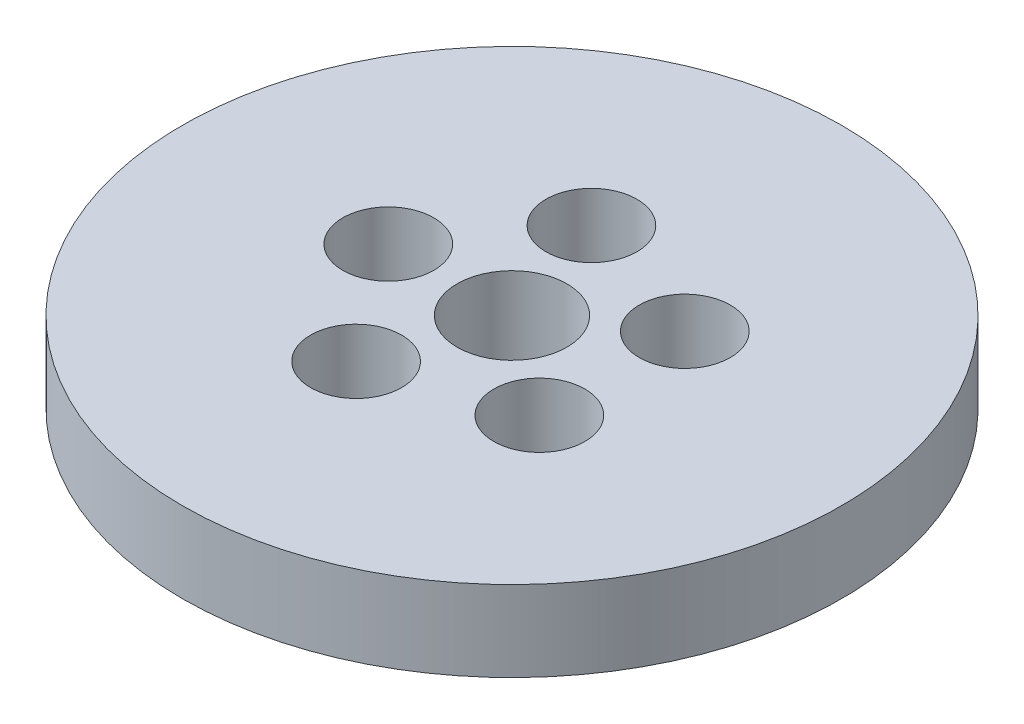
ISO-10303-21;
HEADER;
FILE_DESCRIPTION(('STEP AP214'),'2;1');
FILE_NAME('part.step','',(''),(''),'','','');
FILE_SCHEMA(('AUTOMOTIVE_DESIGN { 1 0 10303 214 1 1 1 1 }'));
ENDSEC;
DATA;
#1=APPLICATION_CONTEXT('core data for automotive mechanical design processes');
#2=APPLICATION_PROTOCOL_DEFINITION('international standard','automotive_design',2000,#1);
#3=PRODUCT_CONTEXT('',#1,'mechanical');
#4=PRODUCT('Part','Part','',(#3));
#5=PRODUCT_RELATED_PRODUCT_CATEGORY('part','',(#4));
#6=PRODUCT_DEFINITION_FORMATION('','',#4);
#7=PRODUCT_DEFINITION_CONTEXT('part definition',#1,'design');
#8=PRODUCT_DEFINITION('design','',#6,#7);
#9=PRODUCT_DEFINITION_SHAPE('','',#8);
#10=(LENGTH_UNIT() NAMED_UNIT(*) SI_UNIT(.MILLI.,.METRE.));
#11=(NAMED_UNIT(*) PLANE_ANGLE_UNIT() SI_UNIT($,.RADIAN.));
#12=(NAMED_UNIT(*) SI_UNIT($,.STERADIAN.) SOLID_ANGLE_UNIT());
#13=UNCERTAINTY_MEASURE_WITH_UNIT(LENGTH_MEASURE(1.E-05),#10,'distance_accuracy_value','');
#14=(GEOMETRIC_REPRESENTATION_CONTEXT(3) GLOBAL_UNCERTAINTY_ASSIGNED_CONTEXT((#13)) GLOBAL_UNIT_ASSIGNED_CONTEXT((#10,
#11,#12)) REPRESENTATION_CONTEXT('',''));
#15=CARTESIAN_POINT('',(0.,0.,0.));
#16=DIRECTION('',(0.,0.,1.));
#17=DIRECTION('',(1.,0.,0.));
#18=AXIS2_PLACEMENT_3D('',#15,#16,#17);
#19=CARTESIAN_POINT('',(0.,11.,0.));
#20=DIRECTION('',(0.,-1.,0.));
#21=DIRECTION('',(0.,0.,-1.));
#22=AXIS2_PLACEMENT_3D('',#19,#20,#21);
#23=CYLINDRICAL_SURFACE('',#22,45.);
#24=CARTESIAN_POINT('',(0.,11.,0.));
#25=DIRECTION('',(0.,1.,0.));
#26=DIRECTION('',(0.,0.,1.));
#27=AXIS2_PLACEMENT_3D('',#24,#25,#26);
#28=CIRCLE('',#27,45.);
#29=CARTESIAN_POINT('',(0.,11.,45.));
#30=VERTEX_POINT('',#29);
#31=EDGE_CURVE('E10',#30,#30,#28,.T.);
#32=ORIENTED_EDGE('',*,*,#31,.F.);
#33=EDGE_LOOP('',(#32));
#34=FACE_BOUND('',#33,.T.);
#35=CARTESIAN_POINT('',(0.,0.,0.));
#36=DIRECTION('',(0.,1.,0.));
#37=DIRECTION('',(0.,0.,1.));
#38=AXIS2_PLACEMENT_3D('',#35,#36,#37);
#39=CIRCLE('',#38,45.);
#40=CARTESIAN_POINT('',(0.,0.,45.));
#41=VERTEX_POINT('',#40);
#42=EDGE_CURVE('E37',#41,#41,#39,.T.);
#43=ORIENTED_EDGE('',*,*,#42,.T.);
#44=EDGE_LOOP('',(#43));
#45=FACE_BOUND('',#44,.T.);
#46=ADVANCED_FACE('F40',(#34,#45),#23,.T.);
#47=CARTESIAN_POINT('',(0.,11.,0.));
#48=DIRECTION('',(0.,1.,0.));
#49=DIRECTION('',(0.,0.,1.));
#50=AXIS2_PLACEMENT_3D('',#47,#48,#49);
#51=PLANE('',#50);
#52=CARTESIAN_POINT('',(-5.22009665162509,11.,-16.0658055271696));
#53=DIRECTION('',(0.,1.,0.));
#54=DIRECTION('',(-0.95105651629515,0.,0.309016994374958));
#55=AXIS2_PLACEMENT_3D('',#52,#53,#54);
#56=CIRCLE('',#55,6.2176523093823);
#57=CARTESIAN_POINT('',(-11.1334353965207,11.,-14.1444452984558));
#58=VERTEX_POINT('',#57);
#59=EDGE_CURVE('E70',#58,#58,#56,.T.);
#60=ORIENTED_EDGE('',*,*,#59,.F.);
#61=EDGE_LOOP('',(#60));
#62=FACE_BOUND('',#61,.T.);
#63=CARTESIAN_POINT('',(13.6663904585134,11.,-9.92921387243688));
#64=DIRECTION('',(0.,1.,0.));
#65=DIRECTION('',(-0.58778525229248,0.,-0.809016994374942));
#66=AXIS2_PLACEMENT_3D('',#63,#64,#65);
#67=CIRCLE('',#66,6.2176523093823);
#68=CARTESIAN_POINT('',(10.0117461271762,11.,-14.9594002558418));
#69=VERTEX_POINT('',#68);
#70=EDGE_CURVE('E71',#69,#69,#67,.T.);
#71=ORIENTED_EDGE('',*,*,#70,.F.);
#72=EDGE_LOOP('',(#71));
#73=FACE_BOUND('',#72,.T.);
#74=CARTESIAN_POINT('',(13.6663904585136,11.,9.92921387243669));
#75=DIRECTION('',(0.,1.,0.));
#76=DIRECTION('',(0.587785252292469,0.,-0.809016994374951));
#77=AXIS2_PLACEMENT_3D('',#74,#75,#76);
#78=CIRCLE('',#77,6.2176523093823);
#79=CARTESIAN_POINT('',(17.3210347898507,11.,4.89902748903175));
#80=VERTEX_POINT('',#79);
#81=EDGE_CURVE('E78',#80,#80,#78,.T.);
#82=ORIENTED_EDGE('',*,*,#81,.F.);
#83=EDGE_LOOP('',(#82));
#84=FACE_BOUND('',#83,.T.);
#85=CARTESIAN_POINT('',(-5.22009665162486,11.,16.0658055271697));
#86=DIRECTION('',(0.,1.,0.));
#87=DIRECTION('',(0.951056516295155,0.,0.309016994374945));
#88=AXIS2_PLACEMENT_3D('',#85,#86,#87);
#89=CIRCLE('',#88,6.2176523093823);
#90=CARTESIAN_POINT('',(0.693242093270787,11.,17.9871657558834));
#91=VERTEX_POINT('',#90);
#92=EDGE_CURVE('E61',#91,#91,#89,.T.);
#93=ORIENTED_EDGE('',*,*,#92,.F.);
#94=EDGE_LOOP('',(#93));
#95=FACE_BOUND('',#94,.T.);
#96=CARTESIAN_POINT('',(-16.8925876137772,11.,0.));
#97=DIRECTION('',(0.,1.,0.));
#98=DIRECTION('',(0.,0.,1.));
#99=AXIS2_PLACEMENT_3D('',#96,#97,#98);
#100=CIRCLE('',#99,6.2176523093823);
#101=CARTESIAN_POINT('',(-16.8925876137772,11.,6.2176523093823));
#102=VERTEX_POINT('',#101);
#103=EDGE_CURVE('E54',#102,#102,#100,.T.);
#104=ORIENTED_EDGE('',*,*,#103,.F.);
#105=EDGE_LOOP('',(#104));
#106=FACE_BOUND('',#105,.T.);
#107=CARTESIAN_POINT('',(0.,11.,0.));
#108=DIRECTION('',(0.,1.,0.));
#109=DIRECTION('',(0.,0.,1.));
#110=AXIS2_PLACEMENT_3D('',#107,#108,#109);
#111=CIRCLE('',#110,7.5);
#112=CARTESIAN_POINT('',(0.,11.,7.5));
#113=VERTEX_POINT('',#112);
#114=EDGE_CURVE('E50',#113,#113,#111,.T.);
#115=ORIENTED_EDGE('',*,*,#114,.F.);
#116=EDGE_LOOP('',(#115));
#117=FACE_BOUND('',#116,.T.);
#118=ORIENTED_EDGE('',*,*,#31,.T.);
#119=EDGE_LOOP('',(#118));
#120=FACE_BOUND('',#119,.T.);
#121=ADVANCED_FACE('F94',(#62,#73,#84,#95,#106,#117,#120),#51,.T.);
#122=CARTESIAN_POINT('',(0.,0.,0.));
#123=DIRECTION('',(0.,1.,0.));
#124=DIRECTION('',(0.,0.,1.));
#125=AXIS2_PLACEMENT_3D('',#122,#123,#124);
#126=PLANE('',#125);
#127=CARTESIAN_POINT('',(0.,0.,0.));
#128=DIRECTION('',(0.,1.,0.));
#129=DIRECTION('',(0.,0.,1.));
#130=AXIS2_PLACEMENT_3D('',#127,#128,#129);
#131=CIRCLE('',#130,7.5);
#132=CARTESIAN_POINT('',(0.,0.,7.5));
#133=VERTEX_POINT('',#132);
#134=EDGE_CURVE('E47',#133,#133,#131,.T.);
#135=ORIENTED_EDGE('',*,*,#134,.T.);
#136=EDGE_LOOP('',(#135));
#137=FACE_BOUND('',#136,.T.);
#138=ORIENTED_EDGE('',*,*,#42,.F.);
#139=EDGE_LOOP('',(#138));
#140=FACE_BOUND('',#139,.T.);
#141=ADVANCED_FACE('F100',(#137,#140),#126,.F.);
#142=CARTESIAN_POINT('',(0.,11.,0.));
#143=DIRECTION('',(0.,-1.,0.));
#144=DIRECTION('',(0.,0.,-1.));
#145=AXIS2_PLACEMENT_3D('',#142,#143,#144);
#146=CYLINDRICAL_SURFACE('',#145,7.5);
#147=ORIENTED_EDGE('',*,*,#114,.T.);
#148=EDGE_LOOP('',(#147));
#149=FACE_BOUND('',#148,.T.);
#150=ORIENTED_EDGE('',*,*,#134,.F.);
#151=EDGE_LOOP('',(#150));
#152=FACE_BOUND('',#151,.T.);
#153=ADVANCED_FACE('F106',(#149,#152),#146,.F.);
#154=CARTESIAN_POINT('',(-16.8925876137772,0.397864549196438,0.));
#155=DIRECTION('',(0.,1.,0.));
#156=DIRECTION('',(0.,0.,1.));
#157=AXIS2_PLACEMENT_3D('',#154,#155,#156);
#158=CYLINDRICAL_SURFACE('',#157,6.2176523093823);
#159=CARTESIAN_POINT('',(-16.8925876137772,0.397864549196438,0.));
#160=DIRECTION('',(0.,1.,0.));
#161=DIRECTION('',(0.,0.,1.));
#162=AXIS2_PLACEMENT_3D('',#159,#160,#161);
#163=CIRCLE('',#162,6.2176523093823);
#164=CARTESIAN_POINT('',(-16.8925876137772,0.397864549196438,6.2176523093823));
#165=VERTEX_POINT('',#164);
#166=EDGE_CURVE('E55',#165,#165,#163,.T.);
#167=ORIENTED_EDGE('',*,*,#166,.F.);
#168=EDGE_LOOP('',(#167));
#169=FACE_BOUND('',#168,.T.);
#170=ORIENTED_EDGE('',*,*,#103,.T.);
#171=EDGE_LOOP('',(#170));
#172=FACE_BOUND('',#171,.T.);
#173=ADVANCED_FACE('F108',(#169,#172),#158,.F.);
#174=CARTESIAN_POINT('',(-16.8925876137772,0.397864549196438,0.));
#175=DIRECTION('',(0.,1.,0.));
#176=DIRECTION('',(0.,0.,1.));
#177=AXIS2_PLACEMENT_3D('',#174,#175,#176);
#178=PLANE('',#177);
#179=ORIENTED_EDGE('',*,*,#166,.T.);
#180=EDGE_LOOP('',(#179));
#181=FACE_BOUND('',#180,.T.);
#182=ADVANCED_FACE('F138',(#181),#178,.T.);
#183=CARTESIAN_POINT('',(-5.22009665162486,0.397864549196438,16.0658055271697));
#184=DIRECTION('',(0.,1.,0.));
#185=DIRECTION('',(0.,0.,1.));
#186=AXIS2_PLACEMENT_3D('',#183,#184,#185);
#187=CYLINDRICAL_SURFACE('',#186,6.2176523093823);
#188=CARTESIAN_POINT('',(-5.22009665162486,0.397864549196438,16.0658055271697));
#189=DIRECTION('',(0.,1.,0.));
#190=DIRECTION('',(0.951056516295155,0.,0.309016994374945));
#191=AXIS2_PLACEMENT_3D('',#188,#189,#190);
#192=CIRCLE('',#191,6.2176523093823);
#193=CARTESIAN_POINT('',(0.693242093270787,0.397864549196438,17.9871657558834));
#194=VERTEX_POINT('',#193);
#195=EDGE_CURVE('E59',#194,#194,#192,.T.);
#196=ORIENTED_EDGE('',*,*,#195,.F.);
#197=EDGE_LOOP('',(#196));
#198=FACE_BOUND('',#197,.T.);
#199=ORIENTED_EDGE('',*,*,#92,.T.);
#200=EDGE_LOOP('',(#199));
#201=FACE_BOUND('',#200,.T.);
#202=ADVANCED_FACE('F150',(#198,#201),#187,.F.);
#203=CARTESIAN_POINT('',(-5.22009665162486,0.397864549196438,16.0658055271697));
#204=DIRECTION('',(0.,1.,0.));
#205=DIRECTION('',(0.951056516295155,0.,0.309016994374945));
#206=AXIS2_PLACEMENT_3D('',#203,#204,#205);
#207=PLANE('',#206);
#208=ORIENTED_EDGE('',*,*,#195,.T.);
#209=EDGE_LOOP('',(#208));
#210=FACE_BOUND('',#209,.T.);
#211=ADVANCED_FACE('F89',(#210),#207,.T.);
#212=CARTESIAN_POINT('',(13.6663904585136,0.397864549196438,9.92921387243669));
#213=DIRECTION('',(0.,1.,0.));
#214=DIRECTION('',(0.,0.,1.));
#215=AXIS2_PLACEMENT_3D('',#212,#213,#214);
#216=CYLINDRICAL_SURFACE('',#215,6.2176523093823);
#217=CARTESIAN_POINT('',(13.6663904585136,0.397864549196438,9.92921387243669));
#218=DIRECTION('',(0.,1.,0.));
#219=DIRECTION('',(0.587785252292469,0.,-0.809016994374951));
#220=AXIS2_PLACEMENT_3D('',#217,#218,#219);
#221=CIRCLE('',#220,6.2176523093823);
#222=CARTESIAN_POINT('',(17.3210347898507,0.397864549196438,4.89902748903175));
#223=VERTEX_POINT('',#222);
#224=EDGE_CURVE('E63',#223,#223,#221,.T.);
#225=ORIENTED_EDGE('',*,*,#224,.F.);
#226=EDGE_LOOP('',(#225));
#227=FACE_BOUND('',#226,.T.);
#228=ORIENTED_EDGE('',*,*,#81,.T.);
#229=EDGE_LOOP('',(#228));
#230=FACE_BOUND('',#229,.T.);
#231=ADVANCED_FACE('F87',(#227,#230),#216,.F.);
#232=CARTESIAN_POINT('',(13.6663904585136,0.397864549196438,9.92921387243669));
#233=DIRECTION('',(0.,1.,0.));
#234=DIRECTION('',(0.587785252292469,0.,-0.809016994374951));
#235=AXIS2_PLACEMENT_3D('',#232,#233,#234);
#236=PLANE('',#235);
#237=ORIENTED_EDGE('',*,*,#224,.T.);
#238=EDGE_LOOP('',(#237));
#239=FACE_BOUND('',#238,.T.);
#240=ADVANCED_FACE('F84',(#239),#236,.T.);
#241=CARTESIAN_POINT('',(13.6663904585134,0.397864549196438,-9.92921387243688));
#242=DIRECTION('',(0.,1.,0.));
#243=DIRECTION('',(0.,0.,1.));
#244=AXIS2_PLACEMENT_3D('',#241,#242,#243);
#245=CYLINDRICAL_SURFACE('',#244,6.2176523093823);
#246=CARTESIAN_POINT('',(13.6663904585134,0.397864549196438,-9.92921387243688));
#247=DIRECTION('',(0.,1.,0.));
#248=DIRECTION('',(-0.58778525229248,0.,-0.809016994374942));
#249=AXIS2_PLACEMENT_3D('',#246,#247,#248);
#250=CIRCLE('',#249,6.2176523093823);
#251=CARTESIAN_POINT('',(10.0117461271762,0.397864549196438,-14.9594002558418));
#252=VERTEX_POINT('',#251);
#253=EDGE_CURVE('E76',#252,#252,#250,.T.);
#254=ORIENTED_EDGE('',*,*,#253,.F.);
#255=EDGE_LOOP('',(#254));
#256=FACE_BOUND('',#255,.T.);
#257=ORIENTED_EDGE('',*,*,#70,.T.);
#258=EDGE_LOOP('',(#257));
#259=FACE_BOUND('',#258,.T.);
#260=ADVANCED_FACE('F185',(#256,#259),#245,.F.);
#261=CARTESIAN_POINT('',(13.6663904585134,0.397864549196438,-9.92921387243688));
#262=DIRECTION('',(0.,1.,0.));
#263=DIRECTION('',(-0.58778525229248,0.,-0.809016994374942));
#264=AXIS2_PLACEMENT_3D('',#261,#262,#263);
#265=PLANE('',#264);
#266=ORIENTED_EDGE('',*,*,#253,.T.);
#267=EDGE_LOOP('',(#266));
#268=FACE_BOUND('',#267,.T.);
#269=ADVANCED_FACE('F189',(#268),#265,.T.);
#270=CARTESIAN_POINT('',(-5.22009665162509,0.397864549196438,-16.0658055271696));
#271=DIRECTION('',(0.,1.,0.));
#272=DIRECTION('',(0.,0.,1.));
#273=AXIS2_PLACEMENT_3D('',#270,#271,#272);
#274=CYLINDRICAL_SURFACE('',#273,6.2176523093823);
#275=CARTESIAN_POINT('',(-5.22009665162509,0.397864549196438,-16.0658055271696));
#276=DIRECTION('',(0.,1.,0.));
#277=DIRECTION('',(-0.95105651629515,0.,0.309016994374958));
#278=AXIS2_PLACEMENT_3D('',#275,#276,#277);
#279=CIRCLE('',#278,6.2176523093823);
#280=CARTESIAN_POINT('',(-11.1334353965207,0.397864549196438,-14.1444452984558));
#281=VERTEX_POINT('',#280);
#282=EDGE_CURVE('E69',#281,#281,#279,.T.);
#283=ORIENTED_EDGE('',*,*,#282,.F.);
#284=EDGE_LOOP('',(#283));
#285=FACE_BOUND('',#284,.T.);
#286=ORIENTED_EDGE('',*,*,#59,.T.);
#287=EDGE_LOOP('',(#286));
#288=FACE_BOUND('',#287,.T.);
#289=ADVANCED_FACE('F200',(#285,#288),#274,.F.);
#290=CARTESIAN_POINT('',(-5.22009665162509,0.397864549196438,-16.0658055271696));
#291=DIRECTION('',(0.,1.,0.));
#292=DIRECTION('',(-0.95105651629515,0.,0.309016994374958));
#293=AXIS2_PLACEMENT_3D('',#290,#291,#292);
#294=PLANE('',#293);
#295=ORIENTED_EDGE('',*,*,#282,.T.);
#296=EDGE_LOOP('',(#295));
#297=FACE_BOUND('',#296,.T.);
#298=ADVANCED_FACE('F208',(#297),#294,.T.);
#299=CLOSED_SHELL('',(#46,#121,#141,#153,#173,#182,#202,#211,#231,#240,#260,#269,#289,#298));
#300=MANIFOLD_SOLID_BREP('B2',#299);
#301=ADVANCED_BREP_SHAPE_REPRESENTATION('',(#18,#300),#14);
#302=SHAPE_DEFINITION_REPRESENTATION(#9,#301);
ENDSEC;
END-ISO-10303-21;
